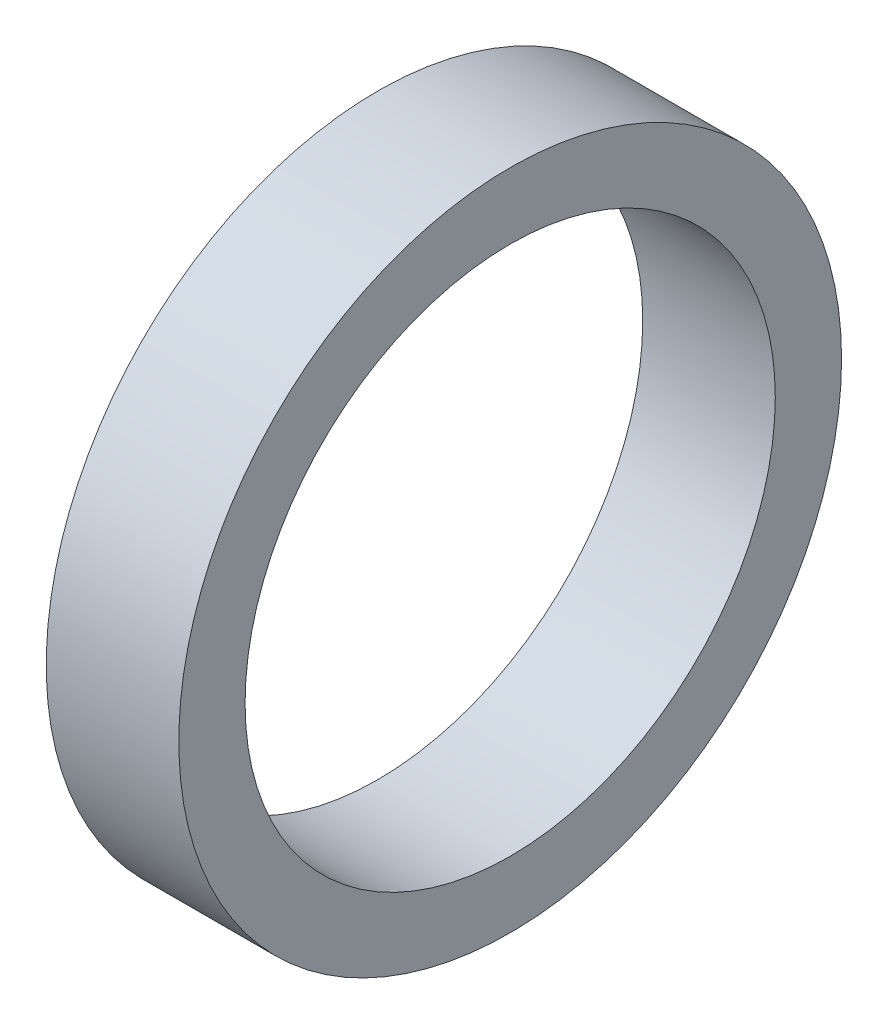
ISO-10303-21;
HEADER;
FILE_DESCRIPTION(('STEP AP214'),'2;1');
FILE_NAME('part.step','',(''),(''),'','','');
FILE_SCHEMA(('AUTOMOTIVE_DESIGN { 1 0 10303 214 1 1 1 1 }'));
ENDSEC;
DATA;
#1=APPLICATION_CONTEXT('core data for automotive mechanical design processes');
#2=APPLICATION_PROTOCOL_DEFINITION('international standard','automotive_design',2000,#1);
#3=PRODUCT_CONTEXT('',#1,'mechanical');
#4=PRODUCT('Part','Part','',(#3));
#5=PRODUCT_RELATED_PRODUCT_CATEGORY('part','',(#4));
#6=PRODUCT_DEFINITION_FORMATION('','',#4);
#7=PRODUCT_DEFINITION_CONTEXT('part definition',#1,'design');
#8=PRODUCT_DEFINITION('design','',#6,#7);
#9=PRODUCT_DEFINITION_SHAPE('','',#8);
#10=(LENGTH_UNIT() NAMED_UNIT(*) SI_UNIT(.MILLI.,.METRE.));
#11=(NAMED_UNIT(*) PLANE_ANGLE_UNIT() SI_UNIT($,.RADIAN.));
#12=(NAMED_UNIT(*) SI_UNIT($,.STERADIAN.) SOLID_ANGLE_UNIT());
#13=UNCERTAINTY_MEASURE_WITH_UNIT(LENGTH_MEASURE(1.E-05),#10,'distance_accuracy_value','');
#14=(GEOMETRIC_REPRESENTATION_CONTEXT(3) GLOBAL_UNCERTAINTY_ASSIGNED_CONTEXT((#13)) GLOBAL_UNIT_ASSIGNED_CONTEXT((#10,
#11,#12)) REPRESENTATION_CONTEXT('',''));
#15=CARTESIAN_POINT('',(0.,0.,0.));
#16=DIRECTION('',(0.,0.,1.));
#17=DIRECTION('',(1.,0.,0.));
#18=AXIS2_PLACEMENT_3D('',#15,#16,#17);
#19=CARTESIAN_POINT('',(1.,0.,0.));
#20=DIRECTION('',(-1.,0.,0.));
#21=DIRECTION('',(0.,0.,1.));
#22=AXIS2_PLACEMENT_3D('',#19,#20,#21);
#23=CYLINDRICAL_SURFACE('',#22,2.5);
#24=CARTESIAN_POINT('',(1.,0.,0.));
#25=DIRECTION('',(1.,0.,0.));
#26=DIRECTION('',(0.,0.,-1.));
#27=AXIS2_PLACEMENT_3D('',#24,#25,#26);
#28=CIRCLE('',#27,2.5);
#29=CARTESIAN_POINT('',(1.,0.,-2.5));
#30=VERTEX_POINT('',#29);
#31=EDGE_CURVE('E10',#30,#30,#28,.T.);
#32=ORIENTED_EDGE('',*,*,#31,.F.);
#33=EDGE_LOOP('',(#32));
#34=FACE_BOUND('',#33,.T.);
#35=CARTESIAN_POINT('',(0.,0.,0.));
#36=DIRECTION('',(1.,0.,0.));
#37=DIRECTION('',(0.,0.,-1.));
#38=AXIS2_PLACEMENT_3D('',#35,#36,#37);
#39=CIRCLE('',#38,2.5);
#40=CARTESIAN_POINT('',(0.,0.,-2.5));
#41=VERTEX_POINT('',#40);
#42=EDGE_CURVE('E34',#41,#41,#39,.T.);
#43=ORIENTED_EDGE('',*,*,#42,.T.);
#44=EDGE_LOOP('',(#43));
#45=FACE_BOUND('',#44,.T.);
#46=ADVANCED_FACE('F31',(#34,#45),#23,.T.);
#47=CARTESIAN_POINT('',(1.,0.,0.));
#48=DIRECTION('',(1.,0.,0.));
#49=DIRECTION('',(0.,0.,-1.));
#50=AXIS2_PLACEMENT_3D('',#47,#48,#49);
#51=PLANE('',#50);
#52=CARTESIAN_POINT('',(1.,0.,0.));
#53=DIRECTION('',(1.,0.,0.));
#54=DIRECTION('',(0.,0.,-1.));
#55=AXIS2_PLACEMENT_3D('',#52,#53,#54);
#56=CIRCLE('',#55,2.);
#57=CARTESIAN_POINT('',(1.,0.,-2.));
#58=VERTEX_POINT('',#57);
#59=EDGE_CURVE('E43',#58,#58,#56,.T.);
#60=ORIENTED_EDGE('',*,*,#59,.F.);
#61=EDGE_LOOP('',(#60));
#62=FACE_BOUND('',#61,.T.);
#63=ORIENTED_EDGE('',*,*,#31,.T.);
#64=EDGE_LOOP('',(#63));
#65=FACE_BOUND('',#64,.T.);
#66=ADVANCED_FACE('F58',(#62,#65),#51,.T.);
#67=CARTESIAN_POINT('',(0.,0.,0.));
#68=DIRECTION('',(1.,0.,0.));
#69=DIRECTION('',(0.,0.,-1.));
#70=AXIS2_PLACEMENT_3D('',#67,#68,#69);
#71=PLANE('',#70);
#72=CARTESIAN_POINT('',(0.,0.,0.));
#73=DIRECTION('',(1.,0.,0.));
#74=DIRECTION('',(0.,0.,-1.));
#75=AXIS2_PLACEMENT_3D('',#72,#73,#74);
#76=CIRCLE('',#75,2.);
#77=CARTESIAN_POINT('',(0.,0.,-2.));
#78=VERTEX_POINT('',#77);
#79=EDGE_CURVE('E41',#78,#78,#76,.T.);
#80=ORIENTED_EDGE('',*,*,#79,.T.);
#81=EDGE_LOOP('',(#80));
#82=FACE_BOUND('',#81,.T.);
#83=ORIENTED_EDGE('',*,*,#42,.F.);
#84=EDGE_LOOP('',(#83));
#85=FACE_BOUND('',#84,.T.);
#86=ADVANCED_FACE('F49',(#82,#85),#71,.F.);
#87=CARTESIAN_POINT('',(0.,0.,0.));
#88=DIRECTION('',(1.,0.,0.));
#89=DIRECTION('',(0.,0.,-1.));
#90=AXIS2_PLACEMENT_3D('',#87,#88,#89);
#91=CYLINDRICAL_SURFACE('',#90,2.);
#92=ORIENTED_EDGE('',*,*,#79,.F.);
#93=EDGE_LOOP('',(#92));
#94=FACE_BOUND('',#93,.T.);
#95=ORIENTED_EDGE('',*,*,#59,.T.);
#96=EDGE_LOOP('',(#95));
#97=FACE_BOUND('',#96,.T.);
#98=ADVANCED_FACE('F52',(#94,#97),#91,.F.);
#99=CLOSED_SHELL('',(#46,#66,#86,#98));
#100=MANIFOLD_SOLID_BREP('B2',#99);
#101=ADVANCED_BREP_SHAPE_REPRESENTATION('',(#18,#100),#14);
#102=SHAPE_DEFINITION_REPRESENTATION(#9,#101);
ENDSEC;
END-ISO-10303-21;
